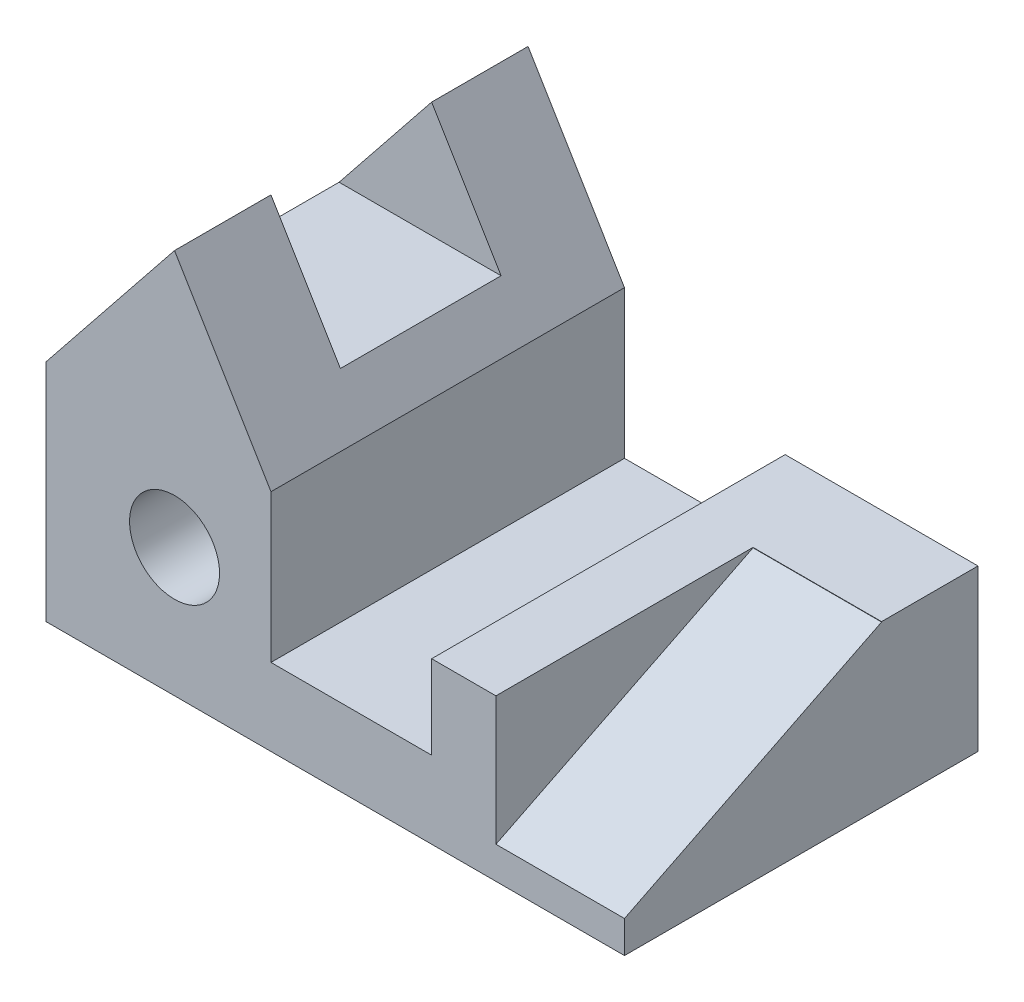
ISO-10303-21;
HEADER;
FILE_DESCRIPTION(('STEP AP214'),'2;1');
FILE_NAME('part.step','',(''),(''),'','','');
FILE_SCHEMA(('AUTOMOTIVE_DESIGN { 1 0 10303 214 1 1 1 1 }'));
ENDSEC;
DATA;
#1=APPLICATION_CONTEXT('core data for automotive mechanical design processes');
#2=APPLICATION_PROTOCOL_DEFINITION('international standard','automotive_design',2000,#1);
#3=PRODUCT_CONTEXT('',#1,'mechanical');
#4=PRODUCT('Part','Part','',(#3));
#5=PRODUCT_RELATED_PRODUCT_CATEGORY('part','',(#4));
#6=PRODUCT_DEFINITION_FORMATION('','',#4);
#7=PRODUCT_DEFINITION_CONTEXT('part definition',#1,'design');
#8=PRODUCT_DEFINITION('design','',#6,#7);
#9=PRODUCT_DEFINITION_SHAPE('','',#8);
#10=(LENGTH_UNIT() NAMED_UNIT(*) SI_UNIT(.MILLI.,.METRE.));
#11=(NAMED_UNIT(*) PLANE_ANGLE_UNIT() SI_UNIT($,.RADIAN.));
#12=(NAMED_UNIT(*) SI_UNIT($,.STERADIAN.) SOLID_ANGLE_UNIT());
#13=UNCERTAINTY_MEASURE_WITH_UNIT(LENGTH_MEASURE(1.E-05),#10,'distance_accuracy_value','');
#14=(GEOMETRIC_REPRESENTATION_CONTEXT(3) GLOBAL_UNCERTAINTY_ASSIGNED_CONTEXT((#13)) GLOBAL_UNIT_ASSIGNED_CONTEXT((#10,
#11,#12)) REPRESENTATION_CONTEXT('',''));
#15=CARTESIAN_POINT('',(0.,0.,0.));
#16=DIRECTION('',(0.,0.,1.));
#17=DIRECTION('',(1.,0.,0.));
#18=AXIS2_PLACEMENT_3D('',#15,#16,#17);
#19=CARTESIAN_POINT('',(70.,25.,0.));
#20=DIRECTION('',(-1.,0.,0.));
#21=DIRECTION('',(0.,0.,1.));
#22=AXIS2_PLACEMENT_3D('',#19,#20,#21);
#23=PLANE('',#22);
#24=DIRECTION('',(0.,-1.,0.));
#25=VECTOR('',#24,1.);
#26=CARTESIAN_POINT('',(70.,25.,55.));
#27=LINE('',#26,#25);
#28=CARTESIAN_POINT('',(70.,25.,55.));
#29=VERTEX_POINT('',#28);
#30=CARTESIAN_POINT('',(70.,5.,55.));
#31=VERTEX_POINT('',#30);
#32=EDGE_CURVE('E214',#29,#31,#27,.T.);
#33=ORIENTED_EDGE('',*,*,#32,.T.);
#34=DIRECTION('',(0.,0.446197813109813,-0.894934361602023));
#35=VECTOR('',#34,1.);
#36=CARTESIAN_POINT('',(70.,24.9432643221374,15.));
#37=LINE('',#36,#35);
#38=CARTESIAN_POINT('',(70.,24.9432643221374,15.));
#39=VERTEX_POINT('',#38);
#40=EDGE_CURVE('E255',#31,#39,#37,.T.);
#41=ORIENTED_EDGE('',*,*,#40,.T.);
#42=DIRECTION('',(0.,-1.,0.));
#43=VECTOR('',#42,1.);
#44=CARTESIAN_POINT('',(70.,25.,15.));
#45=LINE('',#44,#43);
#46=CARTESIAN_POINT('',(70.,25.,15.));
#47=VERTEX_POINT('',#46);
#48=EDGE_CURVE('E195',#47,#39,#45,.T.);
#49=ORIENTED_EDGE('',*,*,#48,.F.);
#50=DIRECTION('',(0.,0.,-1.));
#51=VECTOR('',#50,1.);
#52=CARTESIAN_POINT('',(70.,25.,0.));
#53=LINE('',#52,#51);
#54=EDGE_CURVE('E201',#29,#47,#53,.T.);
#55=ORIENTED_EDGE('',*,*,#54,.F.);
#56=EDGE_LOOP('',(#33,#41,#49,#55));
#57=FACE_BOUND('',#56,.T.);
#58=ADVANCED_FACE('F41',(#57),#23,.F.);
#59=CARTESIAN_POINT('',(0.,5.,0.));
#60=DIRECTION('',(1.,0.,0.));
#61=DIRECTION('',(0.,0.,-1.));
#62=AXIS2_PLACEMENT_3D('',#59,#60,#61);
#63=PLANE('',#62);
#64=DIRECTION('',(0.,0.,1.));
#65=VECTOR('',#64,1.);
#66=CARTESIAN_POINT('',(0.,0.,0.));
#67=LINE('',#66,#65);
#68=CARTESIAN_POINT('',(0.,0.,0.));
#69=VERTEX_POINT('',#68);
#70=CARTESIAN_POINT('',(0.,0.,55.));
#71=VERTEX_POINT('',#70);
#72=EDGE_CURVE('E228',#69,#71,#67,.T.);
#73=ORIENTED_EDGE('',*,*,#72,.T.);
#74=DIRECTION('',(0.,-1.,0.));
#75=VECTOR('',#74,1.);
#76=CARTESIAN_POINT('',(0.,5.,55.));
#77=LINE('',#76,#75);
#78=CARTESIAN_POINT('',(0.,35.,55.));
#79=VERTEX_POINT('',#78);
#80=EDGE_CURVE('E249',#79,#71,#77,.T.);
#81=ORIENTED_EDGE('',*,*,#80,.F.);
#82=DIRECTION('',(0.,0.,1.));
#83=VECTOR('',#82,1.);
#84=CARTESIAN_POINT('',(0.,35.,0.));
#85=LINE('',#84,#83);
#86=CARTESIAN_POINT('',(0.,35.,0.));
#87=VERTEX_POINT('',#86);
#88=EDGE_CURVE('E217',#87,#79,#85,.T.);
#89=ORIENTED_EDGE('',*,*,#88,.F.);
#90=DIRECTION('',(0.,-1.,0.));
#91=VECTOR('',#90,1.);
#92=CARTESIAN_POINT('',(0.,5.,0.));
#93=LINE('',#92,#91);
#94=EDGE_CURVE('E232',#87,#69,#93,.T.);
#95=ORIENTED_EDGE('',*,*,#94,.T.);
#96=EDGE_LOOP('',(#73,#81,#89,#95));
#97=FACE_BOUND('',#96,.T.);
#98=ADVANCED_FACE('F290',(#97),#63,.F.);
#99=CARTESIAN_POINT('',(0.,5.,55.));
#100=DIRECTION('',(0.,0.,-1.));
#101=DIRECTION('',(-1.,0.,0.));
#102=AXIS2_PLACEMENT_3D('',#99,#100,#101);
#103=PLANE('',#102);
#104=CARTESIAN_POINT('',(20.,20.,55.));
#105=DIRECTION('',(0.,0.,1.));
#106=DIRECTION('',(1.,0.,0.));
#107=AXIS2_PLACEMENT_3D('',#104,#105,#106);
#108=CIRCLE('',#107,7.);
#109=CARTESIAN_POINT('',(27.,20.,55.));
#110=VERTEX_POINT('',#109);
#111=EDGE_CURVE('E281',#110,#110,#108,.T.);
#112=ORIENTED_EDGE('',*,*,#111,.F.);
#113=EDGE_LOOP('',(#112));
#114=FACE_BOUND('',#113,.T.);
#115=DIRECTION('',(1.,0.,0.));
#116=VECTOR('',#115,1.);
#117=CARTESIAN_POINT('',(0.,0.,55.));
#118=LINE('',#117,#116);
#119=CARTESIAN_POINT('',(90.,0.,55.));
#120=VERTEX_POINT('',#119);
#121=EDGE_CURVE('E236',#71,#120,#118,.T.);
#122=ORIENTED_EDGE('',*,*,#121,.T.);
#123=DIRECTION('',(0.,-1.,0.));
#124=VECTOR('',#123,1.);
#125=CARTESIAN_POINT('',(90.,5.,55.));
#126=LINE('',#125,#124);
#127=CARTESIAN_POINT('',(90.,5.,55.));
#128=VERTEX_POINT('',#127);
#129=EDGE_CURVE('E246',#128,#120,#126,.T.);
#130=ORIENTED_EDGE('',*,*,#129,.F.);
#131=DIRECTION('',(1.,0.,0.));
#132=VECTOR('',#131,1.);
#133=CARTESIAN_POINT('',(0.,5.,55.));
#134=LINE('',#133,#132);
#135=EDGE_CURVE('E229',#31,#128,#134,.T.);
#136=ORIENTED_EDGE('',*,*,#135,.F.);
#137=ORIENTED_EDGE('',*,*,#32,.F.);
#138=DIRECTION('',(1.,0.,0.));
#139=VECTOR('',#138,1.);
#140=CARTESIAN_POINT('',(60.,25.,55.));
#141=LINE('',#140,#139);
#142=CARTESIAN_POINT('',(60.,25.,55.));
#143=VERTEX_POINT('',#142);
#144=EDGE_CURVE('E198',#143,#29,#141,.T.);
#145=ORIENTED_EDGE('',*,*,#144,.F.);
#146=DIRECTION('',(0.,-1.,0.));
#147=VECTOR('',#146,1.);
#148=CARTESIAN_POINT('',(60.,25.,55.));
#149=LINE('',#148,#147);
#150=CARTESIAN_POINT('',(60.,12.,55.));
#151=VERTEX_POINT('',#150);
#152=EDGE_CURVE('E208',#143,#151,#149,.T.);
#153=ORIENTED_EDGE('',*,*,#152,.T.);
#154=DIRECTION('',(1.,0.,0.));
#155=VECTOR('',#154,1.);
#156=CARTESIAN_POINT('',(35.,12.,55.));
#157=LINE('',#156,#155);
#158=CARTESIAN_POINT('',(35.,12.,55.));
#159=VERTEX_POINT('',#158);
#160=EDGE_CURVE('E65',#159,#151,#157,.T.);
#161=ORIENTED_EDGE('',*,*,#160,.F.);
#162=DIRECTION('',(0.,-1.,0.));
#163=VECTOR('',#162,1.);
#164=CARTESIAN_POINT('',(35.,35.,55.));
#165=LINE('',#164,#163);
#166=CARTESIAN_POINT('',(35.,35.,55.));
#167=VERTEX_POINT('',#166);
#168=EDGE_CURVE('E225',#167,#159,#165,.T.);
#169=ORIENTED_EDGE('',*,*,#168,.F.);
#170=DIRECTION('',(-0.514495755427527,0.857492925712544,0.));
#171=VECTOR('',#170,1.);
#172=CARTESIAN_POINT('',(20.,60.,55.));
#173=LINE('',#172,#171);
#174=CARTESIAN_POINT('',(20.,60.,55.));
#175=VERTEX_POINT('',#174);
#176=EDGE_CURVE('E269',#167,#175,#173,.T.);
#177=ORIENTED_EDGE('',*,*,#176,.T.);
#178=DIRECTION('',(-0.624695047554424,-0.78086880944303,0.));
#179=VECTOR('',#178,1.);
#180=CARTESIAN_POINT('',(0.,35.,55.));
#181=LINE('',#180,#179);
#182=EDGE_CURVE('E179',#175,#79,#181,.T.);
#183=ORIENTED_EDGE('',*,*,#182,.T.);
#184=ORIENTED_EDGE('',*,*,#80,.T.);
#185=EDGE_LOOP('',(#122,#130,#136,#137,#145,#153,#161,#169,#177,#183,#184));
#186=FACE_BOUND('',#185,.T.);
#187=ADVANCED_FACE('F287',(#114,#186),#103,.F.);
#188=CARTESIAN_POINT('',(90.,5.,0.));
#189=DIRECTION('',(-1.,0.,0.));
#190=DIRECTION('',(0.,0.,1.));
#191=AXIS2_PLACEMENT_3D('',#188,#189,#190);
#192=PLANE('',#191);
#193=DIRECTION('',(0.,-0.446197813109813,0.894934361602023));
#194=VECTOR('',#193,1.);
#195=CARTESIAN_POINT('',(90.,26.9624765263006,10.9500868633188));
#196=LINE('',#195,#194);
#197=CARTESIAN_POINT('',(90.,24.9432643221374,15.));
#198=VERTEX_POINT('',#197);
#199=EDGE_CURVE('E155',#198,#128,#196,.T.);
#200=ORIENTED_EDGE('',*,*,#199,.T.);
#201=ORIENTED_EDGE('',*,*,#129,.T.);
#202=DIRECTION('',(0.,0.,-1.));
#203=VECTOR('',#202,1.);
#204=CARTESIAN_POINT('',(90.,0.,0.));
#205=LINE('',#204,#203);
#206=CARTESIAN_POINT('',(90.,0.,0.));
#207=VERTEX_POINT('',#206);
#208=EDGE_CURVE('E238',#120,#207,#205,.T.);
#209=ORIENTED_EDGE('',*,*,#208,.T.);
#210=DIRECTION('',(0.,-1.,0.));
#211=VECTOR('',#210,1.);
#212=CARTESIAN_POINT('',(90.,5.,0.));
#213=LINE('',#212,#211);
#214=CARTESIAN_POINT('',(90.,25.,0.));
#215=VERTEX_POINT('',#214);
#216=EDGE_CURVE('E244',#215,#207,#213,.T.);
#217=ORIENTED_EDGE('',*,*,#216,.F.);
#218=DIRECTION('',(0.,0.,-1.));
#219=VECTOR('',#218,1.);
#220=CARTESIAN_POINT('',(90.,25.,0.));
#221=LINE('',#220,#219);
#222=CARTESIAN_POINT('',(90.,25.,15.));
#223=VERTEX_POINT('',#222);
#224=EDGE_CURVE('E189',#223,#215,#221,.T.);
#225=ORIENTED_EDGE('',*,*,#224,.F.);
#226=DIRECTION('',(0.,-1.,0.));
#227=VECTOR('',#226,1.);
#228=CARTESIAN_POINT('',(90.,25.,15.));
#229=LINE('',#228,#227);
#230=EDGE_CURVE('E192',#223,#198,#229,.T.);
#231=ORIENTED_EDGE('',*,*,#230,.T.);
#232=EDGE_LOOP('',(#200,#201,#209,#217,#225,#231));
#233=FACE_BOUND('',#232,.T.);
#234=ADVANCED_FACE('F289',(#233),#192,.F.);
#235=CARTESIAN_POINT('',(0.,5.,0.));
#236=DIRECTION('',(0.,0.,1.));
#237=DIRECTION('',(1.,0.,0.));
#238=AXIS2_PLACEMENT_3D('',#235,#236,#237);
#239=PLANE('',#238);
#240=CARTESIAN_POINT('',(20.,20.,0.));
#241=DIRECTION('',(0.,0.,1.));
#242=DIRECTION('',(1.,0.,0.));
#243=AXIS2_PLACEMENT_3D('',#240,#241,#242);
#244=CIRCLE('',#243,6.99999999999999);
#245=CARTESIAN_POINT('',(27.,20.,0.));
#246=VERTEX_POINT('',#245);
#247=EDGE_CURVE('E161',#246,#246,#244,.T.);
#248=ORIENTED_EDGE('',*,*,#247,.T.);
#249=EDGE_LOOP('',(#248));
#250=FACE_BOUND('',#249,.T.);
#251=DIRECTION('',(0.,-1.,0.));
#252=VECTOR('',#251,1.);
#253=CARTESIAN_POINT('',(60.,25.,0.));
#254=LINE('',#253,#252);
#255=CARTESIAN_POINT('',(60.,25.,0.));
#256=VERTEX_POINT('',#255);
#257=CARTESIAN_POINT('',(60.,12.,0.));
#258=VERTEX_POINT('',#257);
#259=EDGE_CURVE('E211',#256,#258,#254,.T.);
#260=ORIENTED_EDGE('',*,*,#259,.F.);
#261=DIRECTION('',(-1.,0.,0.));
#262=VECTOR('',#261,1.);
#263=CARTESIAN_POINT('',(60.,25.,0.));
#264=LINE('',#263,#262);
#265=EDGE_CURVE('E204',#215,#256,#264,.T.);
#266=ORIENTED_EDGE('',*,*,#265,.F.);
#267=ORIENTED_EDGE('',*,*,#216,.T.);
#268=DIRECTION('',(-1.,0.,0.));
#269=VECTOR('',#268,1.);
#270=CARTESIAN_POINT('',(0.,0.,0.));
#271=LINE('',#270,#269);
#272=EDGE_CURVE('E233',#207,#69,#271,.T.);
#273=ORIENTED_EDGE('',*,*,#272,.T.);
#274=ORIENTED_EDGE('',*,*,#94,.F.);
#275=DIRECTION('',(-0.624695047554424,-0.78086880944303,0.));
#276=VECTOR('',#275,1.);
#277=CARTESIAN_POINT('',(0.,35.,0.));
#278=LINE('',#277,#276);
#279=CARTESIAN_POINT('',(20.,60.,0.));
#280=VERTEX_POINT('',#279);
#281=EDGE_CURVE('E177',#280,#87,#278,.T.);
#282=ORIENTED_EDGE('',*,*,#281,.F.);
#283=DIRECTION('',(-0.514495755427527,0.857492925712544,0.));
#284=VECTOR('',#283,1.);
#285=CARTESIAN_POINT('',(20.,60.,0.));
#286=LINE('',#285,#284);
#287=CARTESIAN_POINT('',(35.,35.,0.));
#288=VERTEX_POINT('',#287);
#289=EDGE_CURVE('E169',#288,#280,#286,.T.);
#290=ORIENTED_EDGE('',*,*,#289,.F.);
#291=DIRECTION('',(0.,-1.,0.));
#292=VECTOR('',#291,1.);
#293=CARTESIAN_POINT('',(35.,35.,0.));
#294=LINE('',#293,#292);
#295=CARTESIAN_POINT('',(35.,12.,0.));
#296=VERTEX_POINT('',#295);
#297=EDGE_CURVE('E222',#288,#296,#294,.T.);
#298=ORIENTED_EDGE('',*,*,#297,.T.);
#299=DIRECTION('',(-1.,0.,0.));
#300=VECTOR('',#299,1.);
#301=CARTESIAN_POINT('',(35.,12.,0.));
#302=LINE('',#301,#300);
#303=EDGE_CURVE('E185',#258,#296,#302,.T.);
#304=ORIENTED_EDGE('',*,*,#303,.F.);
#305=EDGE_LOOP('',(#260,#266,#267,#273,#274,#282,#290,#298,#304));
#306=FACE_BOUND('',#305,.T.);
#307=ADVANCED_FACE('F301',(#250,#306),#239,.F.);
#308=CARTESIAN_POINT('',(0.,0.,0.));
#309=DIRECTION('',(0.,1.,0.));
#310=DIRECTION('',(0.,0.,1.));
#311=AXIS2_PLACEMENT_3D('',#308,#309,#310);
#312=PLANE('',#311);
#313=ORIENTED_EDGE('',*,*,#72,.F.);
#314=ORIENTED_EDGE('',*,*,#272,.F.);
#315=ORIENTED_EDGE('',*,*,#208,.F.);
#316=ORIENTED_EDGE('',*,*,#121,.F.);
#317=EDGE_LOOP('',(#313,#314,#315,#316));
#318=FACE_BOUND('',#317,.T.);
#319=ADVANCED_FACE('F298',(#318),#312,.F.);
#320=CARTESIAN_POINT('',(35.,35.,0.));
#321=DIRECTION('',(1.,0.,0.));
#322=DIRECTION('',(0.,0.,-1.));
#323=AXIS2_PLACEMENT_3D('',#320,#321,#322);
#324=PLANE('',#323);
#325=DIRECTION('',(0.,0.,1.));
#326=VECTOR('',#325,1.);
#327=CARTESIAN_POINT('',(35.,12.,0.));
#328=LINE('',#327,#326);
#329=EDGE_CURVE('E173',#296,#159,#328,.T.);
#330=ORIENTED_EDGE('',*,*,#329,.F.);
#331=ORIENTED_EDGE('',*,*,#297,.F.);
#332=DIRECTION('',(0.,0.,1.));
#333=VECTOR('',#332,1.);
#334=CARTESIAN_POINT('',(35.,35.,0.));
#335=LINE('',#334,#333);
#336=EDGE_CURVE('E220',#288,#167,#335,.T.);
#337=ORIENTED_EDGE('',*,*,#336,.T.);
#338=ORIENTED_EDGE('',*,*,#168,.T.);
#339=EDGE_LOOP('',(#330,#331,#337,#338));
#340=FACE_BOUND('',#339,.T.);
#341=ADVANCED_FACE('F307',(#340),#324,.T.);
#342=CARTESIAN_POINT('',(60.,25.,0.));
#343=DIRECTION('',(1.,0.,0.));
#344=DIRECTION('',(0.,0.,-1.));
#345=AXIS2_PLACEMENT_3D('',#342,#343,#344);
#346=PLANE('',#345);
#347=ORIENTED_EDGE('',*,*,#259,.T.);
#348=DIRECTION('',(0.,0.,-1.));
#349=VECTOR('',#348,1.);
#350=CARTESIAN_POINT('',(60.,12.,0.));
#351=LINE('',#350,#349);
#352=EDGE_CURVE('E183',#151,#258,#351,.T.);
#353=ORIENTED_EDGE('',*,*,#352,.F.);
#354=ORIENTED_EDGE('',*,*,#152,.F.);
#355=DIRECTION('',(0.,0.,1.));
#356=VECTOR('',#355,1.);
#357=CARTESIAN_POINT('',(60.,25.,0.));
#358=LINE('',#357,#356);
#359=EDGE_CURVE('E206',#256,#143,#358,.T.);
#360=ORIENTED_EDGE('',*,*,#359,.F.);
#361=EDGE_LOOP('',(#347,#353,#354,#360));
#362=FACE_BOUND('',#361,.T.);
#363=ADVANCED_FACE('F311',(#362),#346,.F.);
#364=CARTESIAN_POINT('',(0.,25.,0.));
#365=DIRECTION('',(0.,-1.,0.));
#366=DIRECTION('',(0.,0.,-1.));
#367=AXIS2_PLACEMENT_3D('',#364,#365,#366);
#368=PLANE('',#367);
#369=ORIENTED_EDGE('',*,*,#265,.T.);
#370=ORIENTED_EDGE('',*,*,#359,.T.);
#371=ORIENTED_EDGE('',*,*,#144,.T.);
#372=ORIENTED_EDGE('',*,*,#54,.T.);
#373=DIRECTION('',(1.,0.,0.));
#374=VECTOR('',#373,1.);
#375=CARTESIAN_POINT('',(70.,25.,15.));
#376=LINE('',#375,#374);
#377=EDGE_CURVE('E187',#47,#223,#376,.T.);
#378=ORIENTED_EDGE('',*,*,#377,.T.);
#379=ORIENTED_EDGE('',*,*,#224,.T.);
#380=EDGE_LOOP('',(#369,#370,#371,#372,#378,#379));
#381=FACE_BOUND('',#380,.T.);
#382=ADVANCED_FACE('F316',(#381),#368,.F.);
#383=CARTESIAN_POINT('',(70.,25.,15.));
#384=DIRECTION('',(0.,0.,-1.));
#385=DIRECTION('',(-1.,0.,0.));
#386=AXIS2_PLACEMENT_3D('',#383,#384,#385);
#387=PLANE('',#386);
#388=ORIENTED_EDGE('',*,*,#48,.T.);
#389=DIRECTION('',(1.,0.,0.));
#390=VECTOR('',#389,1.);
#391=CARTESIAN_POINT('',(70.,24.9432643221374,15.));
#392=LINE('',#391,#390);
#393=EDGE_CURVE('E252',#39,#198,#392,.T.);
#394=ORIENTED_EDGE('',*,*,#393,.T.);
#395=ORIENTED_EDGE('',*,*,#230,.F.);
#396=ORIENTED_EDGE('',*,*,#377,.F.);
#397=EDGE_LOOP('',(#388,#394,#395,#396));
#398=FACE_BOUND('',#397,.T.);
#399=ADVANCED_FACE('F320',(#398),#387,.F.);
#400=CARTESIAN_POINT('',(70.,24.9432643221374,15.));
#401=DIRECTION('',(0.,-0.894934361602023,-0.446197813109813));
#402=DIRECTION('',(1.,0.,0.));
#403=AXIS2_PLACEMENT_3D('',#400,#401,#402);
#404=PLANE('',#403);
#405=ORIENTED_EDGE('',*,*,#40,.F.);
#406=ORIENTED_EDGE('',*,*,#135,.T.);
#407=ORIENTED_EDGE('',*,*,#199,.F.);
#408=ORIENTED_EDGE('',*,*,#393,.F.);
#409=EDGE_LOOP('',(#405,#406,#407,#408));
#410=FACE_BOUND('',#409,.T.);
#411=ADVANCED_FACE('F44',(#410),#404,.F.);
#412=CARTESIAN_POINT('',(0.,12.,0.));
#413=DIRECTION('',(0.,1.,0.));
#414=DIRECTION('',(0.,0.,1.));
#415=AXIS2_PLACEMENT_3D('',#412,#413,#414);
#416=PLANE('',#415);
#417=ORIENTED_EDGE('',*,*,#329,.T.);
#418=ORIENTED_EDGE('',*,*,#160,.T.);
#419=ORIENTED_EDGE('',*,*,#352,.T.);
#420=ORIENTED_EDGE('',*,*,#303,.T.);
#421=EDGE_LOOP('',(#417,#418,#419,#420));
#422=FACE_BOUND('',#421,.T.);
#423=ADVANCED_FACE('F308',(#422),#416,.T.);
#424=CARTESIAN_POINT('',(0.,35.,0.));
#425=DIRECTION('',(-0.78086880944303,0.624695047554424,0.));
#426=DIRECTION('',(-0.624695047554424,-0.78086880944303,0.));
#427=AXIS2_PLACEMENT_3D('',#424,#425,#426);
#428=PLANE('',#427);
#429=DIRECTION('',(-0.624695047554424,-0.78086880944303,0.));
#430=VECTOR('',#429,1.);
#431=CARTESIAN_POINT('',(0.,35.,15.));
#432=LINE('',#431,#430);
#433=CARTESIAN_POINT('',(20.,60.,15.));
#434=VERTEX_POINT('',#433);
#435=CARTESIAN_POINT('',(5.6,42.,15.));
#436=VERTEX_POINT('',#435);
#437=EDGE_CURVE('E160',#434,#436,#432,.T.);
#438=ORIENTED_EDGE('',*,*,#437,.F.);
#439=DIRECTION('',(0.,0.,1.));
#440=VECTOR('',#439,1.);
#441=CARTESIAN_POINT('',(20.,60.,0.));
#442=LINE('',#441,#440);
#443=EDGE_CURVE('E166',#280,#434,#442,.T.);
#444=ORIENTED_EDGE('',*,*,#443,.F.);
#445=ORIENTED_EDGE('',*,*,#281,.T.);
#446=ORIENTED_EDGE('',*,*,#88,.T.);
#447=ORIENTED_EDGE('',*,*,#182,.F.);
#448=CARTESIAN_POINT('',(20.,60.,40.));
#449=VERTEX_POINT('',#448);
#450=EDGE_CURVE('E174',#449,#175,#442,.T.);
#451=ORIENTED_EDGE('',*,*,#450,.F.);
#452=DIRECTION('',(0.624695047554424,0.78086880944303,0.));
#453=VECTOR('',#452,1.);
#454=CARTESIAN_POINT('',(0.,35.,40.));
#455=LINE('',#454,#453);
#456=CARTESIAN_POINT('',(5.6,42.,40.));
#457=VERTEX_POINT('',#456);
#458=EDGE_CURVE('E260',#457,#449,#455,.T.);
#459=ORIENTED_EDGE('',*,*,#458,.F.);
#460=DIRECTION('',(0.,0.,1.));
#461=VECTOR('',#460,1.);
#462=CARTESIAN_POINT('',(5.6,42.,0.));
#463=LINE('',#462,#461);
#464=EDGE_CURVE('E276',#436,#457,#463,.T.);
#465=ORIENTED_EDGE('',*,*,#464,.F.);
#466=EDGE_LOOP('',(#438,#444,#445,#446,#447,#451,#459,#465));
#467=FACE_BOUND('',#466,.T.);
#468=ADVANCED_FACE('F265',(#467),#428,.T.);
#469=CARTESIAN_POINT('',(20.,60.,0.));
#470=DIRECTION('',(0.857492925712544,0.514495755427527,0.));
#471=DIRECTION('',(-0.514495755427527,0.857492925712544,0.));
#472=AXIS2_PLACEMENT_3D('',#469,#470,#471);
#473=PLANE('',#472);
#474=DIRECTION('',(-0.514495755427527,0.857492925712544,0.));
#475=VECTOR('',#474,1.);
#476=CARTESIAN_POINT('',(20.,60.,15.));
#477=LINE('',#476,#475);
#478=CARTESIAN_POINT('',(30.8,42.,15.));
#479=VERTEX_POINT('',#478);
#480=EDGE_CURVE('E11',#479,#434,#477,.T.);
#481=ORIENTED_EDGE('',*,*,#480,.F.);
#482=DIRECTION('',(0.,0.,-1.));
#483=VECTOR('',#482,1.);
#484=CARTESIAN_POINT('',(30.8,42.,0.));
#485=LINE('',#484,#483);
#486=CARTESIAN_POINT('',(30.8,42.,40.));
#487=VERTEX_POINT('',#486);
#488=EDGE_CURVE('E147',#487,#479,#485,.T.);
#489=ORIENTED_EDGE('',*,*,#488,.F.);
#490=DIRECTION('',(0.514495755427527,-0.857492925712544,0.));
#491=VECTOR('',#490,1.);
#492=CARTESIAN_POINT('',(20.,60.,40.));
#493=LINE('',#492,#491);
#494=EDGE_CURVE('E50',#449,#487,#493,.T.);
#495=ORIENTED_EDGE('',*,*,#494,.F.);
#496=ORIENTED_EDGE('',*,*,#450,.T.);
#497=ORIENTED_EDGE('',*,*,#176,.F.);
#498=ORIENTED_EDGE('',*,*,#336,.F.);
#499=ORIENTED_EDGE('',*,*,#289,.T.);
#500=ORIENTED_EDGE('',*,*,#443,.T.);
#501=EDGE_LOOP('',(#481,#489,#495,#496,#497,#498,#499,#500));
#502=FACE_BOUND('',#501,.T.);
#503=ADVANCED_FACE('F164',(#502),#473,.T.);
#504=CARTESIAN_POINT('',(43.,60.,15.));
#505=DIRECTION('',(0.,0.,-1.));
#506=DIRECTION('',(-1.,0.,0.));
#507=AXIS2_PLACEMENT_3D('',#504,#505,#506);
#508=PLANE('',#507);
#509=ORIENTED_EDGE('',*,*,#437,.T.);
#510=DIRECTION('',(-1.,0.,0.));
#511=VECTOR('',#510,1.);
#512=CARTESIAN_POINT('',(43.,42.,15.));
#513=LINE('',#512,#511);
#514=EDGE_CURVE('E150',#479,#436,#513,.T.);
#515=ORIENTED_EDGE('',*,*,#514,.F.);
#516=ORIENTED_EDGE('',*,*,#480,.T.);
#517=EDGE_LOOP('',(#509,#515,#516));
#518=FACE_BOUND('',#517,.T.);
#519=ADVANCED_FACE('F158',(#518),#508,.F.);
#520=CARTESIAN_POINT('',(43.,60.,40.));
#521=DIRECTION('',(0.,0.,1.));
#522=DIRECTION('',(1.,0.,0.));
#523=AXIS2_PLACEMENT_3D('',#520,#521,#522);
#524=PLANE('',#523);
#525=ORIENTED_EDGE('',*,*,#458,.T.);
#526=ORIENTED_EDGE('',*,*,#494,.T.);
#527=DIRECTION('',(-1.,0.,0.));
#528=VECTOR('',#527,1.);
#529=CARTESIAN_POINT('',(43.,42.,40.));
#530=LINE('',#529,#528);
#531=EDGE_CURVE('E57',#487,#457,#530,.T.);
#532=ORIENTED_EDGE('',*,*,#531,.T.);
#533=EDGE_LOOP('',(#525,#526,#532));
#534=FACE_BOUND('',#533,.T.);
#535=ADVANCED_FACE('F258',(#534),#524,.F.);
#536=CARTESIAN_POINT('',(43.,42.,15.));
#537=DIRECTION('',(0.,-1.,0.));
#538=DIRECTION('',(1.,0.,0.));
#539=AXIS2_PLACEMENT_3D('',#536,#537,#538);
#540=PLANE('',#539);
#541=ORIENTED_EDGE('',*,*,#464,.T.);
#542=ORIENTED_EDGE('',*,*,#531,.F.);
#543=ORIENTED_EDGE('',*,*,#488,.T.);
#544=ORIENTED_EDGE('',*,*,#514,.T.);
#545=EDGE_LOOP('',(#541,#542,#543,#544));
#546=FACE_BOUND('',#545,.T.);
#547=ADVANCED_FACE('F149',(#546),#540,.F.);
#548=CARTESIAN_POINT('',(20.,20.,55.));
#549=DIRECTION('',(0.,0.,1.));
#550=DIRECTION('',(1.,0.,0.));
#551=AXIS2_PLACEMENT_3D('',#548,#549,#550);
#552=CYLINDRICAL_SURFACE('',#551,7.);
#553=ORIENTED_EDGE('',*,*,#247,.F.);
#554=EDGE_LOOP('',(#553));
#555=FACE_BOUND('',#554,.T.);
#556=ORIENTED_EDGE('',*,*,#111,.T.);
#557=EDGE_LOOP('',(#556));
#558=FACE_BOUND('',#557,.T.);
#559=ADVANCED_FACE('F285',(#555,#558),#552,.F.);
#560=CLOSED_SHELL('',(#58,#98,#187,#234,#307,#319,#341,#363,#382,#399,#411,#423,#468,#503,#519,
#535,#547,#559));
#561=MANIFOLD_SOLID_BREP('B2',#560);
#562=ADVANCED_BREP_SHAPE_REPRESENTATION('',(#18,#561),#14);
#563=SHAPE_DEFINITION_REPRESENTATION(#9,#562);
ENDSEC;
END-ISO-10303-21;
